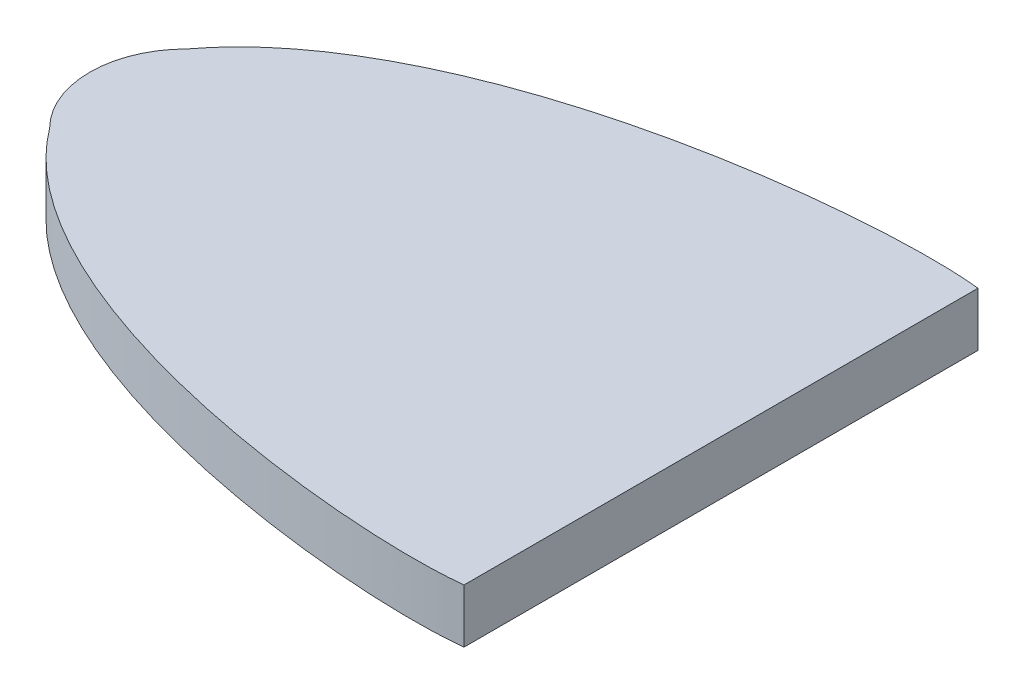
ISO-10303-21;
HEADER;
FILE_DESCRIPTION(('STEP AP214'),'2;1');
FILE_NAME('part.step','',(''),(''),'','','');
FILE_SCHEMA(('AUTOMOTIVE_DESIGN { 1 0 10303 214 1 1 1 1 }'));
ENDSEC;
DATA;
#1=APPLICATION_CONTEXT('core data for automotive mechanical design processes');
#2=APPLICATION_PROTOCOL_DEFINITION('international standard','automotive_design',2000,#1);
#3=PRODUCT_CONTEXT('',#1,'mechanical');
#4=PRODUCT('Part','Part','',(#3));
#5=PRODUCT_RELATED_PRODUCT_CATEGORY('part','',(#4));
#6=PRODUCT_DEFINITION_FORMATION('','',#4);
#7=PRODUCT_DEFINITION_CONTEXT('part definition',#1,'design');
#8=PRODUCT_DEFINITION('design','',#6,#7);
#9=PRODUCT_DEFINITION_SHAPE('','',#8);
#10=(LENGTH_UNIT() NAMED_UNIT(*) SI_UNIT(.MILLI.,.METRE.));
#11=(NAMED_UNIT(*) PLANE_ANGLE_UNIT() SI_UNIT($,.RADIAN.));
#12=(NAMED_UNIT(*) SI_UNIT($,.STERADIAN.) SOLID_ANGLE_UNIT());
#13=UNCERTAINTY_MEASURE_WITH_UNIT(LENGTH_MEASURE(1.E-05),#10,'distance_accuracy_value','');
#14=(GEOMETRIC_REPRESENTATION_CONTEXT(3) GLOBAL_UNCERTAINTY_ASSIGNED_CONTEXT((#13)) GLOBAL_UNIT_ASSIGNED_CONTEXT((#10,
#11,#12)) REPRESENTATION_CONTEXT('',''));
#15=CARTESIAN_POINT('',(0.,0.,0.));
#16=DIRECTION('',(0.,0.,1.));
#17=DIRECTION('',(1.,0.,0.));
#18=AXIS2_PLACEMENT_3D('',#15,#16,#17);
#19=CARTESIAN_POINT('',(-53.263961030679,5.,-6.36396103067889));
#20=CARTESIAN_POINT('',(-41.904509181002,5.,-21.6051932608365));
#21=CARTESIAN_POINT('',(-7.80815290135852,5.,-25.0295585271866));
#22=CARTESIAN_POINT('',(2.68131998276124,5.,-23.8497489116771));
#23=B_SPLINE_CURVE_WITH_KNOTS('',3,(#19,#20,#21,#22),.UNSPECIFIED.,.F.,.F.,(4,4),(0.,1.),.UNSPECIFIED.);
#24=DIRECTION('',(0.,-1.,0.));
#25=VECTOR('',#24,1.);
#26=SURFACE_OF_LINEAR_EXTRUSION('',#23,#25);
#27=CARTESIAN_POINT('',(-53.263961030679,0.,-6.36396103067889));
#28=CARTESIAN_POINT('',(-41.904509181002,0.,-21.6051932608365));
#29=CARTESIAN_POINT('',(-7.80815290135852,0.,-25.0295585271866));
#30=CARTESIAN_POINT('',(2.68131998276124,0.,-23.8497489116771));
#31=B_SPLINE_CURVE_WITH_KNOTS('',3,(#27,#28,#29,#30),.UNSPECIFIED.,.F.,.F.,(4,4),(0.,1.),.UNSPECIFIED.);
#32=CARTESIAN_POINT('',(-53.263961030679,0.,-6.3639610306789));
#33=VERTEX_POINT('',#32);
#34=CARTESIAN_POINT('',(2.68131998276121,0.,-23.8497489116771));
#35=VERTEX_POINT('',#34);
#36=EDGE_CURVE('E114',#33,#35,#31,.T.);
#37=ORIENTED_EDGE('',*,*,#36,.F.);
#38=DIRECTION('',(0.,-1.,0.));
#39=VECTOR('',#38,1.);
#40=CARTESIAN_POINT('',(-53.263961030679,5.,-6.3639610306789));
#41=LINE('',#40,#39);
#42=CARTESIAN_POINT('',(-53.263961030679,5.,-6.3639610306789));
#43=VERTEX_POINT('',#42);
#44=EDGE_CURVE('E11',#43,#33,#41,.T.);
#45=ORIENTED_EDGE('',*,*,#44,.F.);
#46=CARTESIAN_POINT('',(2.68131998276121,5.,-23.8497489116771));
#47=VERTEX_POINT('',#46);
#48=EDGE_CURVE('E85',#43,#47,#23,.T.);
#49=ORIENTED_EDGE('',*,*,#48,.T.);
#50=DIRECTION('',(0.,-1.,0.));
#51=VECTOR('',#50,1.);
#52=CARTESIAN_POINT('',(2.68131998276121,5.,-23.8497489116771));
#53=LINE('',#52,#51);
#54=EDGE_CURVE('E74',#47,#35,#53,.T.);
#55=ORIENTED_EDGE('',*,*,#54,.T.);
#56=EDGE_LOOP('',(#37,#45,#49,#55));
#57=FACE_BOUND('',#56,.T.);
#58=ADVANCED_FACE('F34',(#57),#26,.T.);
#59=CARTESIAN_POINT('',(-46.9,5.,0.));
#60=DIRECTION('',(0.,-1.,0.));
#61=DIRECTION('',(0.,0.,-1.));
#62=AXIS2_PLACEMENT_3D('',#59,#60,#61);
#63=CYLINDRICAL_SURFACE('',#62,9.);
#64=CARTESIAN_POINT('',(-46.9,0.,0.));
#65=DIRECTION('',(0.,1.,0.));
#66=DIRECTION('',(0.,0.,1.));
#67=AXIS2_PLACEMENT_3D('',#64,#65,#66);
#68=CIRCLE('',#67,9.);
#69=CARTESIAN_POINT('',(-53.263961030679,0.,6.3639610306789));
#70=VERTEX_POINT('',#69);
#71=EDGE_CURVE('E90',#33,#70,#68,.T.);
#72=ORIENTED_EDGE('',*,*,#71,.T.);
#73=DIRECTION('',(0.,-1.,0.));
#74=VECTOR('',#73,1.);
#75=CARTESIAN_POINT('',(-53.263961030679,5.,6.3639610306789));
#76=LINE('',#75,#74);
#77=CARTESIAN_POINT('',(-53.263961030679,5.,6.3639610306789));
#78=VERTEX_POINT('',#77);
#79=EDGE_CURVE('E43',#78,#70,#76,.T.);
#80=ORIENTED_EDGE('',*,*,#79,.F.);
#81=CARTESIAN_POINT('',(-46.9,5.,0.));
#82=DIRECTION('',(0.,1.,0.));
#83=DIRECTION('',(0.,0.,1.));
#84=AXIS2_PLACEMENT_3D('',#81,#82,#83);
#85=CIRCLE('',#84,9.);
#86=EDGE_CURVE('E80',#43,#78,#85,.T.);
#87=ORIENTED_EDGE('',*,*,#86,.F.);
#88=ORIENTED_EDGE('',*,*,#44,.T.);
#89=EDGE_LOOP('',(#72,#80,#87,#88));
#90=FACE_BOUND('',#89,.T.);
#91=ADVANCED_FACE('F88',(#90),#63,.T.);
#92=CARTESIAN_POINT('',(-53.263961030679,5.,6.36396103067889));
#93=CARTESIAN_POINT('',(-41.904509181002,5.,21.6051932608365));
#94=CARTESIAN_POINT('',(-7.80815290135852,5.,25.0295585271866));
#95=CARTESIAN_POINT('',(2.68131998276124,5.,23.8497489116771));
#96=B_SPLINE_CURVE_WITH_KNOTS('',3,(#92,#93,#94,#95),.UNSPECIFIED.,.F.,.F.,(4,4),(0.,1.),.UNSPECIFIED.);
#97=DIRECTION('',(0.,-1.,0.));
#98=VECTOR('',#97,1.);
#99=SURFACE_OF_LINEAR_EXTRUSION('',#96,#98);
#100=CARTESIAN_POINT('',(-53.263961030679,0.,6.36396103067889));
#101=CARTESIAN_POINT('',(-41.904509181002,0.,21.6051932608365));
#102=CARTESIAN_POINT('',(-7.80815290135852,0.,25.0295585271866));
#103=CARTESIAN_POINT('',(2.68131998276124,0.,23.8497489116771));
#104=B_SPLINE_CURVE_WITH_KNOTS('',3,(#100,#101,#102,#103),.UNSPECIFIED.,.F.,.F.,(4,4),(0.,1.),.UNSPECIFIED.);
#105=CARTESIAN_POINT('',(2.68131998276121,0.,23.8497489116771));
#106=VERTEX_POINT('',#105);
#107=EDGE_CURVE('E67',#70,#106,#104,.T.);
#108=ORIENTED_EDGE('',*,*,#107,.T.);
#109=DIRECTION('',(0.,-1.,0.));
#110=VECTOR('',#109,1.);
#111=CARTESIAN_POINT('',(2.68131998276121,5.,23.8497489116771));
#112=LINE('',#111,#110);
#113=CARTESIAN_POINT('',(2.68131998276121,5.,23.8497489116771));
#114=VERTEX_POINT('',#113);
#115=EDGE_CURVE('E91',#114,#106,#112,.T.);
#116=ORIENTED_EDGE('',*,*,#115,.F.);
#117=EDGE_CURVE('E84',#78,#114,#96,.T.);
#118=ORIENTED_EDGE('',*,*,#117,.F.);
#119=ORIENTED_EDGE('',*,*,#79,.T.);
#120=EDGE_LOOP('',(#108,#116,#118,#119));
#121=FACE_BOUND('',#120,.T.);
#122=ADVANCED_FACE('F92',(#121),#99,.F.);
#123=CARTESIAN_POINT('',(2.68131998276121,5.,0.));
#124=DIRECTION('',(-1.,0.,0.));
#125=DIRECTION('',(0.,0.,1.));
#126=AXIS2_PLACEMENT_3D('',#123,#124,#125);
#127=PLANE('',#126);
#128=DIRECTION('',(0.,0.,-1.));
#129=VECTOR('',#128,1.);
#130=CARTESIAN_POINT('',(2.68131998276121,0.,0.));
#131=LINE('',#130,#129);
#132=EDGE_CURVE('E127',#106,#35,#131,.T.);
#133=ORIENTED_EDGE('',*,*,#132,.T.);
#134=ORIENTED_EDGE('',*,*,#54,.F.);
#135=DIRECTION('',(0.,0.,-1.));
#136=VECTOR('',#135,1.);
#137=CARTESIAN_POINT('',(2.68131998276121,5.,0.));
#138=LINE('',#137,#136);
#139=EDGE_CURVE('E51',#114,#47,#138,.T.);
#140=ORIENTED_EDGE('',*,*,#139,.F.);
#141=ORIENTED_EDGE('',*,*,#115,.T.);
#142=EDGE_LOOP('',(#133,#134,#140,#141));
#143=FACE_BOUND('',#142,.T.);
#144=ADVANCED_FACE('F105',(#143),#127,.F.);
#145=CARTESIAN_POINT('',(0.,5.,0.));
#146=DIRECTION('',(0.,1.,0.));
#147=DIRECTION('',(0.,0.,1.));
#148=AXIS2_PLACEMENT_3D('',#145,#146,#147);
#149=PLANE('',#148);
#150=ORIENTED_EDGE('',*,*,#48,.F.);
#151=ORIENTED_EDGE('',*,*,#86,.T.);
#152=ORIENTED_EDGE('',*,*,#117,.T.);
#153=ORIENTED_EDGE('',*,*,#139,.T.);
#154=EDGE_LOOP('',(#150,#151,#152,#153));
#155=FACE_BOUND('',#154,.T.);
#156=ADVANCED_FACE('F82',(#155),#149,.T.);
#157=CARTESIAN_POINT('',(0.,0.,0.));
#158=DIRECTION('',(0.,1.,0.));
#159=DIRECTION('',(0.,0.,1.));
#160=AXIS2_PLACEMENT_3D('',#157,#158,#159);
#161=PLANE('',#160);
#162=ORIENTED_EDGE('',*,*,#36,.T.);
#163=ORIENTED_EDGE('',*,*,#132,.F.);
#164=ORIENTED_EDGE('',*,*,#107,.F.);
#165=ORIENTED_EDGE('',*,*,#71,.F.);
#166=EDGE_LOOP('',(#162,#163,#164,#165));
#167=FACE_BOUND('',#166,.T.);
#168=ADVANCED_FACE('F134',(#167),#161,.F.);
#169=CLOSED_SHELL('',(#58,#91,#122,#144,#156,#168));
#170=MANIFOLD_SOLID_BREP('B2',#169);
#171=ADVANCED_BREP_SHAPE_REPRESENTATION('',(#18,#170),#14);
#172=SHAPE_DEFINITION_REPRESENTATION(#9,#171);
ENDSEC;
END-ISO-10303-21;
